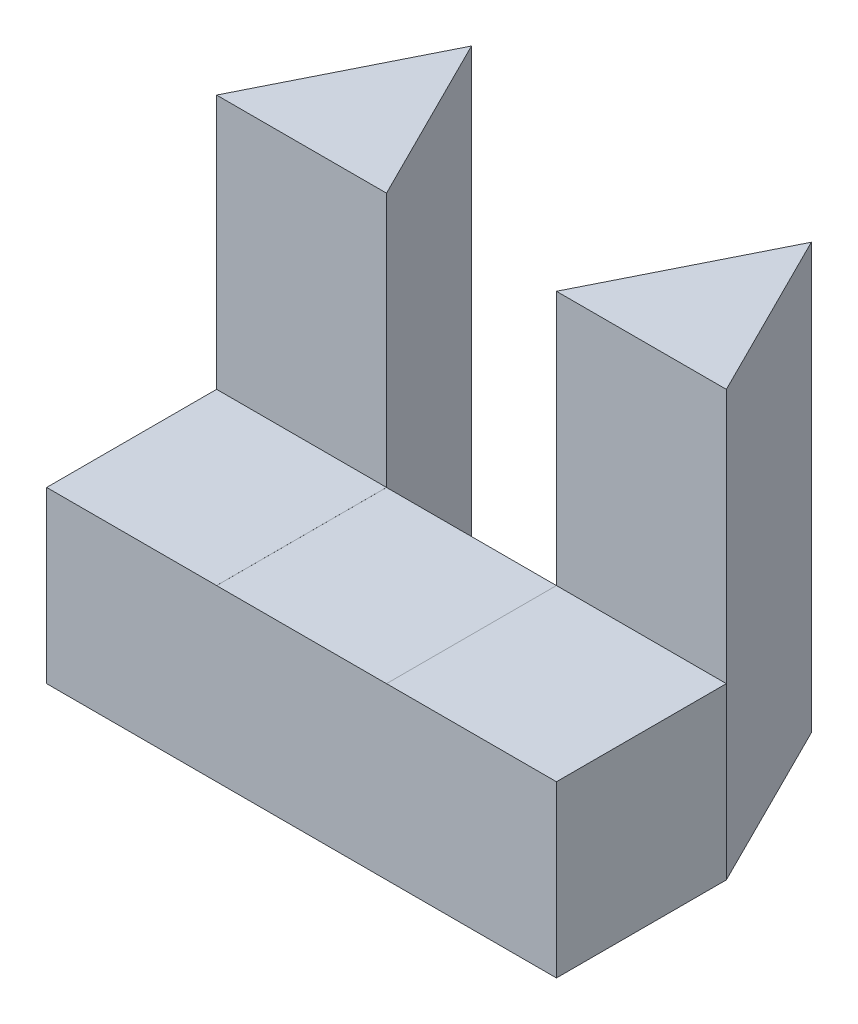
ISO-10303-21;
HEADER;
FILE_DESCRIPTION(('STEP AP214'),'2;1');
FILE_NAME('part.step','',(''),(''),'','','');
FILE_SCHEMA(('AUTOMOTIVE_DESIGN { 1 0 10303 214 1 1 1 1 }'));
ENDSEC;
DATA;
#1=APPLICATION_CONTEXT('core data for automotive mechanical design processes');
#2=APPLICATION_PROTOCOL_DEFINITION('international standard','automotive_design',2000,#1);
#3=PRODUCT_CONTEXT('',#1,'mechanical');
#4=PRODUCT('Part','Part','',(#3));
#5=PRODUCT_RELATED_PRODUCT_CATEGORY('part','',(#4));
#6=PRODUCT_DEFINITION_FORMATION('','',#4);
#7=PRODUCT_DEFINITION_CONTEXT('part definition',#1,'design');
#8=PRODUCT_DEFINITION('design','',#6,#7);
#9=PRODUCT_DEFINITION_SHAPE('','',#8);
#10=(LENGTH_UNIT() NAMED_UNIT(*) SI_UNIT(.MILLI.,.METRE.));
#11=(NAMED_UNIT(*) PLANE_ANGLE_UNIT() SI_UNIT($,.RADIAN.));
#12=(NAMED_UNIT(*) SI_UNIT($,.STERADIAN.) SOLID_ANGLE_UNIT());
#13=UNCERTAINTY_MEASURE_WITH_UNIT(LENGTH_MEASURE(1.E-05),#10,'distance_accuracy_value','');
#14=(GEOMETRIC_REPRESENTATION_CONTEXT(3) GLOBAL_UNCERTAINTY_ASSIGNED_CONTEXT((#13)) GLOBAL_UNIT_ASSIGNED_CONTEXT((#10,
#11,#12)) REPRESENTATION_CONTEXT('',''));
#15=CARTESIAN_POINT('',(0.,0.,0.));
#16=DIRECTION('',(0.,0.,1.));
#17=DIRECTION('',(1.,0.,0.));
#18=AXIS2_PLACEMENT_3D('',#15,#16,#17);
#19=CARTESIAN_POINT('',(0.,5.,0.));
#20=DIRECTION('',(0.,1.,0.));
#21=DIRECTION('',(0.,0.,1.));
#22=AXIS2_PLACEMENT_3D('',#19,#20,#21);
#23=PLANE('',#22);
#24=DIRECTION('',(-1.,0.,0.));
#25=VECTOR('',#24,1.);
#26=CARTESIAN_POINT('',(15.,5.,-2.));
#27=LINE('',#26,#25);
#28=CARTESIAN_POINT('',(2.,5.,-2.));
#29=VERTEX_POINT('',#28);
#30=CARTESIAN_POINT('',(0.,5.,-2.));
#31=VERTEX_POINT('',#30);
#32=EDGE_CURVE('E139',#29,#31,#27,.T.);
#33=ORIENTED_EDGE('',*,*,#32,.F.);
#34=DIRECTION('',(-0.447213595499958,0.,-0.894427190999916));
#35=VECTOR('',#34,1.);
#36=CARTESIAN_POINT('',(2.,5.,-2.));
#37=LINE('',#36,#35);
#38=CARTESIAN_POINT('',(1.,5.,-4.));
#39=VERTEX_POINT('',#38);
#40=EDGE_CURVE('E159',#29,#39,#37,.T.);
#41=ORIENTED_EDGE('',*,*,#40,.T.);
#42=DIRECTION('',(-0.447213595499958,0.,0.894427190999916));
#43=VECTOR('',#42,1.);
#44=CARTESIAN_POINT('',(1.,5.,-4.));
#45=LINE('',#44,#43);
#46=EDGE_CURVE('E158',#39,#31,#45,.T.);
#47=ORIENTED_EDGE('',*,*,#46,.T.);
#48=EDGE_LOOP('',(#33,#41,#47));
#49=FACE_BOUND('',#48,.T.);
#50=ADVANCED_FACE('F33',(#49),#23,.T.);
#51=CARTESIAN_POINT('',(0.,5.,-2.));
#52=DIRECTION('',(1.,0.,0.));
#53=DIRECTION('',(0.,0.,-1.));
#54=AXIS2_PLACEMENT_3D('',#51,#52,#53);
#55=PLANE('',#54);
#56=DIRECTION('',(0.,-1.,0.));
#57=VECTOR('',#56,1.);
#58=CARTESIAN_POINT('',(0.,5.,0.));
#59=LINE('',#58,#57);
#60=CARTESIAN_POINT('',(0.,2.00044380215793,0.));
#61=VERTEX_POINT('',#60);
#62=CARTESIAN_POINT('',(0.,0.,0.));
#63=VERTEX_POINT('',#62);
#64=EDGE_CURVE('E151',#61,#63,#59,.T.);
#65=ORIENTED_EDGE('',*,*,#64,.F.);
#66=DIRECTION('',(0.,0.,1.));
#67=VECTOR('',#66,1.);
#68=CARTESIAN_POINT('',(0.,2.00044380215793,-2.));
#69=LINE('',#68,#67);
#70=CARTESIAN_POINT('',(0.,2.00044380215793,-2.));
#71=VERTEX_POINT('',#70);
#72=EDGE_CURVE('E130',#71,#61,#69,.T.);
#73=ORIENTED_EDGE('',*,*,#72,.F.);
#74=DIRECTION('',(0.,-1.,0.));
#75=VECTOR('',#74,1.);
#76=CARTESIAN_POINT('',(0.,5.,-2.));
#77=LINE('',#76,#75);
#78=CARTESIAN_POINT('',(0.,0.,-2.));
#79=VERTEX_POINT('',#78);
#80=EDGE_CURVE('E145',#71,#79,#77,.T.);
#81=ORIENTED_EDGE('',*,*,#80,.T.);
#82=DIRECTION('',(0.,0.,1.));
#83=VECTOR('',#82,1.);
#84=CARTESIAN_POINT('',(0.,0.,-2.));
#85=LINE('',#84,#83);
#86=EDGE_CURVE('E211',#79,#63,#85,.T.);
#87=ORIENTED_EDGE('',*,*,#86,.T.);
#88=EDGE_LOOP('',(#65,#73,#81,#87));
#89=FACE_BOUND('',#88,.T.);
#90=ADVANCED_FACE('F35',(#89),#55,.F.);
#91=CARTESIAN_POINT('',(0.,5.,0.));
#92=DIRECTION('',(0.,0.,-1.));
#93=DIRECTION('',(-1.,0.,0.));
#94=AXIS2_PLACEMENT_3D('',#91,#92,#93);
#95=PLANE('',#94);
#96=DIRECTION('',(0.,-1.,0.));
#97=VECTOR('',#96,1.);
#98=CARTESIAN_POINT('',(6.,5.,0.));
#99=LINE('',#98,#97);
#100=CARTESIAN_POINT('',(6.,2.00044380215793,0.));
#101=VERTEX_POINT('',#100);
#102=CARTESIAN_POINT('',(6.,0.,0.));
#103=VERTEX_POINT('',#102);
#104=EDGE_CURVE('E181',#101,#103,#99,.T.);
#105=ORIENTED_EDGE('',*,*,#104,.F.);
#106=DIRECTION('',(-1.,0.,0.));
#107=VECTOR('',#106,1.);
#108=CARTESIAN_POINT('',(15.,2.00044380215793,0.));
#109=LINE('',#108,#107);
#110=CARTESIAN_POINT('',(4.,2.00044380215793,0.));
#111=VERTEX_POINT('',#110);
#112=EDGE_CURVE('E253',#101,#111,#109,.T.);
#113=ORIENTED_EDGE('',*,*,#112,.T.);
#114=DIRECTION('',(0.,1.,0.));
#115=VECTOR('',#114,1.);
#116=CARTESIAN_POINT('',(4.,5.,0.));
#117=LINE('',#116,#115);
#118=CARTESIAN_POINT('',(4.,2.,0.));
#119=VERTEX_POINT('',#118);
#120=EDGE_CURVE('E216',#119,#111,#117,.T.);
#121=ORIENTED_EDGE('',*,*,#120,.F.);
#122=DIRECTION('',(1.,0.,0.));
#123=VECTOR('',#122,1.);
#124=CARTESIAN_POINT('',(2.,2.,0.));
#125=LINE('',#124,#123);
#126=CARTESIAN_POINT('',(2.,2.,0.));
#127=VERTEX_POINT('',#126);
#128=EDGE_CURVE('E209',#127,#119,#125,.T.);
#129=ORIENTED_EDGE('',*,*,#128,.F.);
#130=DIRECTION('',(0.,-1.,0.));
#131=VECTOR('',#130,1.);
#132=CARTESIAN_POINT('',(2.,5.,0.));
#133=LINE('',#132,#131);
#134=CARTESIAN_POINT('',(2.,2.00044380215793,0.));
#135=VERTEX_POINT('',#134);
#136=EDGE_CURVE('E252',#135,#127,#133,.T.);
#137=ORIENTED_EDGE('',*,*,#136,.F.);
#138=EDGE_CURVE('E48',#135,#61,#109,.T.);
#139=ORIENTED_EDGE('',*,*,#138,.T.);
#140=ORIENTED_EDGE('',*,*,#64,.T.);
#141=DIRECTION('',(1.,0.,0.));
#142=VECTOR('',#141,1.);
#143=CARTESIAN_POINT('',(0.,0.,0.));
#144=LINE('',#143,#142);
#145=EDGE_CURVE('E214',#63,#103,#144,.T.);
#146=ORIENTED_EDGE('',*,*,#145,.T.);
#147=EDGE_LOOP('',(#105,#113,#121,#129,#137,#139,#140,#146));
#148=FACE_BOUND('',#147,.T.);
#149=ADVANCED_FACE('F249',(#148),#95,.F.);
#150=CARTESIAN_POINT('',(6.,5.,0.));
#151=DIRECTION('',(-1.,0.,0.));
#152=DIRECTION('',(0.,0.,1.));
#153=AXIS2_PLACEMENT_3D('',#150,#151,#152);
#154=PLANE('',#153);
#155=DIRECTION('',(0.,-1.,0.));
#156=VECTOR('',#155,1.);
#157=CARTESIAN_POINT('',(6.,5.,-2.));
#158=LINE('',#157,#156);
#159=CARTESIAN_POINT('',(6.,2.00044380215793,-2.));
#160=VERTEX_POINT('',#159);
#161=CARTESIAN_POINT('',(6.,0.,-2.));
#162=VERTEX_POINT('',#161);
#163=EDGE_CURVE('E177',#160,#162,#158,.T.);
#164=ORIENTED_EDGE('',*,*,#163,.F.);
#165=DIRECTION('',(0.,0.,1.));
#166=VECTOR('',#165,1.);
#167=CARTESIAN_POINT('',(6.,2.00044380215793,0.));
#168=LINE('',#167,#166);
#169=EDGE_CURVE('E258',#160,#101,#168,.T.);
#170=ORIENTED_EDGE('',*,*,#169,.T.);
#171=ORIENTED_EDGE('',*,*,#104,.T.);
#172=DIRECTION('',(0.,0.,-1.));
#173=VECTOR('',#172,1.);
#174=CARTESIAN_POINT('',(6.,0.,0.));
#175=LINE('',#174,#173);
#176=EDGE_CURVE('E229',#103,#162,#175,.T.);
#177=ORIENTED_EDGE('',*,*,#176,.T.);
#178=EDGE_LOOP('',(#164,#170,#171,#177));
#179=FACE_BOUND('',#178,.T.);
#180=ADVANCED_FACE('F265',(#179),#154,.F.);
#181=CARTESIAN_POINT('',(6.,5.,-2.));
#182=DIRECTION('',(-0.894427190999916,0.,0.447213595499958));
#183=DIRECTION('',(0.447213595499958,0.,0.894427190999916));
#184=AXIS2_PLACEMENT_3D('',#181,#182,#183);
#185=PLANE('',#184);
#186=DIRECTION('',(-0.447213595499958,0.,-0.894427190999916));
#187=VECTOR('',#186,1.);
#188=CARTESIAN_POINT('',(6.,0.,-2.));
#189=LINE('',#188,#187);
#190=CARTESIAN_POINT('',(5.,0.,-4.));
#191=VERTEX_POINT('',#190);
#192=EDGE_CURVE('E232',#162,#191,#189,.T.);
#193=ORIENTED_EDGE('',*,*,#192,.T.);
#194=DIRECTION('',(0.,-1.,0.));
#195=VECTOR('',#194,1.);
#196=CARTESIAN_POINT('',(5.,5.,-4.));
#197=LINE('',#196,#195);
#198=CARTESIAN_POINT('',(5.,5.,-4.));
#199=VERTEX_POINT('',#198);
#200=EDGE_CURVE('E173',#199,#191,#197,.T.);
#201=ORIENTED_EDGE('',*,*,#200,.F.);
#202=DIRECTION('',(-0.447213595499958,0.,-0.894427190999916));
#203=VECTOR('',#202,1.);
#204=CARTESIAN_POINT('',(6.,5.,-2.));
#205=LINE('',#204,#203);
#206=CARTESIAN_POINT('',(6.,5.,-2.));
#207=VERTEX_POINT('',#206);
#208=EDGE_CURVE('E221',#207,#199,#205,.T.);
#209=ORIENTED_EDGE('',*,*,#208,.F.);
#210=EDGE_CURVE('E178',#207,#160,#158,.T.);
#211=ORIENTED_EDGE('',*,*,#210,.T.);
#212=ORIENTED_EDGE('',*,*,#163,.T.);
#213=EDGE_LOOP('',(#193,#201,#209,#211,#212));
#214=FACE_BOUND('',#213,.T.);
#215=ADVANCED_FACE('F268',(#214),#185,.F.);
#216=CARTESIAN_POINT('',(5.,5.,-4.));
#217=DIRECTION('',(0.894427190999916,0.,0.447213595499958));
#218=DIRECTION('',(0.447213595499958,0.,-0.894427190999916));
#219=AXIS2_PLACEMENT_3D('',#216,#217,#218);
#220=PLANE('',#219);
#221=DIRECTION('',(-0.447213595499958,0.,0.894427190999916));
#222=VECTOR('',#221,1.);
#223=CARTESIAN_POINT('',(5.,0.,-4.));
#224=LINE('',#223,#222);
#225=CARTESIAN_POINT('',(4.,0.,-2.));
#226=VERTEX_POINT('',#225);
#227=EDGE_CURVE('E200',#191,#226,#224,.T.);
#228=ORIENTED_EDGE('',*,*,#227,.T.);
#229=DIRECTION('',(0.,-1.,0.));
#230=VECTOR('',#229,1.);
#231=CARTESIAN_POINT('',(4.,5.,-2.));
#232=LINE('',#231,#230);
#233=CARTESIAN_POINT('',(4.,2.,-2.));
#234=VERTEX_POINT('',#233);
#235=EDGE_CURVE('E169',#234,#226,#232,.T.);
#236=ORIENTED_EDGE('',*,*,#235,.F.);
#237=CARTESIAN_POINT('',(4.,2.00044380215793,-2.));
#238=VERTEX_POINT('',#237);
#239=EDGE_CURVE('E174',#238,#234,#232,.T.);
#240=ORIENTED_EDGE('',*,*,#239,.F.);
#241=CARTESIAN_POINT('',(4.,5.,-2.));
#242=VERTEX_POINT('',#241);
#243=EDGE_CURVE('E171',#242,#238,#232,.T.);
#244=ORIENTED_EDGE('',*,*,#243,.F.);
#245=DIRECTION('',(-0.447213595499958,0.,0.894427190999916));
#246=VECTOR('',#245,1.);
#247=CARTESIAN_POINT('',(5.,5.,-4.));
#248=LINE('',#247,#246);
#249=EDGE_CURVE('E223',#199,#242,#248,.T.);
#250=ORIENTED_EDGE('',*,*,#249,.F.);
#251=ORIENTED_EDGE('',*,*,#200,.T.);
#252=EDGE_LOOP('',(#228,#236,#240,#244,#250,#251));
#253=FACE_BOUND('',#252,.T.);
#254=ADVANCED_FACE('F197',(#253),#220,.F.);
#255=CARTESIAN_POINT('',(4.,5.,-2.));
#256=DIRECTION('',(0.,0.,1.));
#257=DIRECTION('',(1.,0.,0.));
#258=AXIS2_PLACEMENT_3D('',#255,#256,#257);
#259=PLANE('',#258);
#260=DIRECTION('',(0.,-1.,0.));
#261=VECTOR('',#260,1.);
#262=CARTESIAN_POINT('',(2.,5.,-2.));
#263=LINE('',#262,#261);
#264=CARTESIAN_POINT('',(2.,2.,-2.));
#265=VERTEX_POINT('',#264);
#266=CARTESIAN_POINT('',(2.,0.,-2.));
#267=VERTEX_POINT('',#266);
#268=EDGE_CURVE('E165',#265,#267,#263,.T.);
#269=ORIENTED_EDGE('',*,*,#268,.F.);
#270=DIRECTION('',(1.,0.,0.));
#271=VECTOR('',#270,1.);
#272=CARTESIAN_POINT('',(4.,2.,-2.));
#273=LINE('',#272,#271);
#274=EDGE_CURVE('E41',#265,#234,#273,.T.);
#275=ORIENTED_EDGE('',*,*,#274,.T.);
#276=ORIENTED_EDGE('',*,*,#235,.T.);
#277=DIRECTION('',(-1.,0.,0.));
#278=VECTOR('',#277,1.);
#279=CARTESIAN_POINT('',(4.,0.,-2.));
#280=LINE('',#279,#278);
#281=EDGE_CURVE('E235',#226,#267,#280,.T.);
#282=ORIENTED_EDGE('',*,*,#281,.T.);
#283=EDGE_LOOP('',(#269,#275,#276,#282));
#284=FACE_BOUND('',#283,.T.);
#285=ADVANCED_FACE('F188',(#284),#259,.F.);
#286=CARTESIAN_POINT('',(2.,5.,-2.));
#287=DIRECTION('',(-0.894427190999916,0.,0.447213595499958));
#288=DIRECTION('',(0.447213595499958,0.,0.894427190999916));
#289=AXIS2_PLACEMENT_3D('',#286,#287,#288);
#290=PLANE('',#289);
#291=DIRECTION('',(-0.447213595499958,0.,-0.894427190999916));
#292=VECTOR('',#291,1.);
#293=CARTESIAN_POINT('',(2.,0.,-2.));
#294=LINE('',#293,#292);
#295=CARTESIAN_POINT('',(1.,0.,-4.));
#296=VERTEX_POINT('',#295);
#297=EDGE_CURVE('E236',#267,#296,#294,.T.);
#298=ORIENTED_EDGE('',*,*,#297,.T.);
#299=DIRECTION('',(0.,-1.,0.));
#300=VECTOR('',#299,1.);
#301=CARTESIAN_POINT('',(1.,5.,-4.));
#302=LINE('',#301,#300);
#303=EDGE_CURVE('E144',#39,#296,#302,.T.);
#304=ORIENTED_EDGE('',*,*,#303,.F.);
#305=ORIENTED_EDGE('',*,*,#40,.F.);
#306=CARTESIAN_POINT('',(2.,2.00044380215793,-2.));
#307=VERTEX_POINT('',#306);
#308=EDGE_CURVE('E166',#29,#307,#263,.T.);
#309=ORIENTED_EDGE('',*,*,#308,.T.);
#310=EDGE_CURVE('E170',#307,#265,#263,.T.);
#311=ORIENTED_EDGE('',*,*,#310,.T.);
#312=ORIENTED_EDGE('',*,*,#268,.T.);
#313=EDGE_LOOP('',(#298,#304,#305,#309,#311,#312));
#314=FACE_BOUND('',#313,.T.);
#315=ADVANCED_FACE('F240',(#314),#290,.F.);
#316=CARTESIAN_POINT('',(1.,5.,-4.));
#317=DIRECTION('',(0.894427190999916,0.,0.447213595499958));
#318=DIRECTION('',(0.447213595499958,0.,-0.894427190999916));
#319=AXIS2_PLACEMENT_3D('',#316,#317,#318);
#320=PLANE('',#319);
#321=DIRECTION('',(-0.447213595499958,0.,0.894427190999916));
#322=VECTOR('',#321,1.);
#323=CARTESIAN_POINT('',(1.,0.,-4.));
#324=LINE('',#323,#322);
#325=EDGE_CURVE('E156',#296,#79,#324,.T.);
#326=ORIENTED_EDGE('',*,*,#325,.T.);
#327=ORIENTED_EDGE('',*,*,#80,.F.);
#328=EDGE_CURVE('E136',#31,#71,#77,.T.);
#329=ORIENTED_EDGE('',*,*,#328,.F.);
#330=ORIENTED_EDGE('',*,*,#46,.F.);
#331=ORIENTED_EDGE('',*,*,#303,.T.);
#332=EDGE_LOOP('',(#326,#327,#329,#330,#331));
#333=FACE_BOUND('',#332,.T.);
#334=ADVANCED_FACE('F153',(#333),#320,.F.);
#335=EDGE_CURVE('E259',#207,#242,#27,.T.);
#336=ORIENTED_EDGE('',*,*,#335,.F.);
#337=ORIENTED_EDGE('',*,*,#208,.T.);
#338=ORIENTED_EDGE('',*,*,#249,.T.);
#339=EDGE_LOOP('',(#336,#337,#338));
#340=FACE_BOUND('',#339,.T.);
#341=ADVANCED_FACE('F274',(#340),#23,.T.);
#342=CARTESIAN_POINT('',(0.,0.,0.));
#343=DIRECTION('',(0.,1.,0.));
#344=DIRECTION('',(0.,0.,1.));
#345=AXIS2_PLACEMENT_3D('',#342,#343,#344);
#346=PLANE('',#345);
#347=ORIENTED_EDGE('',*,*,#86,.F.);
#348=ORIENTED_EDGE('',*,*,#325,.F.);
#349=ORIENTED_EDGE('',*,*,#297,.F.);
#350=ORIENTED_EDGE('',*,*,#281,.F.);
#351=ORIENTED_EDGE('',*,*,#227,.F.);
#352=ORIENTED_EDGE('',*,*,#192,.F.);
#353=ORIENTED_EDGE('',*,*,#176,.F.);
#354=ORIENTED_EDGE('',*,*,#145,.F.);
#355=EDGE_LOOP('',(#347,#348,#349,#350,#351,#352,#353,#354));
#356=FACE_BOUND('',#355,.T.);
#357=ADVANCED_FACE('F243',(#356),#346,.F.);
#358=CARTESIAN_POINT('',(2.,2.,-5.));
#359=DIRECTION('',(0.,-1.,0.));
#360=DIRECTION('',(0.,0.,-1.));
#361=AXIS2_PLACEMENT_3D('',#358,#359,#360);
#362=PLANE('',#361);
#363=DIRECTION('',(0.,0.,1.));
#364=VECTOR('',#363,1.);
#365=CARTESIAN_POINT('',(2.,2.,-5.));
#366=LINE('',#365,#364);
#367=EDGE_CURVE('E212',#265,#127,#366,.T.);
#368=ORIENTED_EDGE('',*,*,#367,.T.);
#369=ORIENTED_EDGE('',*,*,#128,.T.);
#370=DIRECTION('',(0.,0.,1.));
#371=VECTOR('',#370,1.);
#372=CARTESIAN_POINT('',(4.,2.,-5.));
#373=LINE('',#372,#371);
#374=EDGE_CURVE('E205',#234,#119,#373,.T.);
#375=ORIENTED_EDGE('',*,*,#374,.F.);
#376=ORIENTED_EDGE('',*,*,#274,.F.);
#377=EDGE_LOOP('',(#368,#369,#375,#376));
#378=FACE_BOUND('',#377,.T.);
#379=ADVANCED_FACE('F207',(#378),#362,.F.);
#380=CARTESIAN_POINT('',(2.,5.,-5.));
#381=DIRECTION('',(-1.,0.,0.));
#382=DIRECTION('',(0.,-1.,0.));
#383=AXIS2_PLACEMENT_3D('',#380,#381,#382);
#384=PLANE('',#383);
#385=ORIENTED_EDGE('',*,*,#310,.F.);
#386=DIRECTION('',(0.,0.,1.));
#387=VECTOR('',#386,1.);
#388=CARTESIAN_POINT('',(2.,2.00044380215793,-5.));
#389=LINE('',#388,#387);
#390=EDGE_CURVE('E131',#307,#135,#389,.T.);
#391=ORIENTED_EDGE('',*,*,#390,.T.);
#392=ORIENTED_EDGE('',*,*,#136,.T.);
#393=ORIENTED_EDGE('',*,*,#367,.F.);
#394=EDGE_LOOP('',(#385,#391,#392,#393));
#395=FACE_BOUND('',#394,.T.);
#396=ADVANCED_FACE('F291',(#395),#384,.F.);
#397=CARTESIAN_POINT('',(4.,5.,-5.));
#398=DIRECTION('',(1.,0.,0.));
#399=DIRECTION('',(0.,0.,-1.));
#400=AXIS2_PLACEMENT_3D('',#397,#398,#399);
#401=PLANE('',#400);
#402=ORIENTED_EDGE('',*,*,#120,.T.);
#403=DIRECTION('',(0.,0.,-1.));
#404=VECTOR('',#403,1.);
#405=CARTESIAN_POINT('',(4.,2.00044380215793,-5.));
#406=LINE('',#405,#404);
#407=EDGE_CURVE('E11',#111,#238,#406,.T.);
#408=ORIENTED_EDGE('',*,*,#407,.T.);
#409=ORIENTED_EDGE('',*,*,#239,.T.);
#410=ORIENTED_EDGE('',*,*,#374,.T.);
#411=EDGE_LOOP('',(#402,#408,#409,#410));
#412=FACE_BOUND('',#411,.T.);
#413=ADVANCED_FACE('F204',(#412),#401,.F.);
#414=CARTESIAN_POINT('',(15.,2.00044380215793,-2.));
#415=DIRECTION('',(0.,-1.,0.));
#416=DIRECTION('',(0.,0.,-1.));
#417=AXIS2_PLACEMENT_3D('',#414,#415,#416);
#418=PLANE('',#417);
#419=DIRECTION('',(-1.,0.,0.));
#420=VECTOR('',#419,1.);
#421=CARTESIAN_POINT('',(15.,2.00044380215793,-2.));
#422=LINE('',#421,#420);
#423=EDGE_CURVE('E56',#160,#238,#422,.T.);
#424=ORIENTED_EDGE('',*,*,#423,.T.);
#425=ORIENTED_EDGE('',*,*,#407,.F.);
#426=ORIENTED_EDGE('',*,*,#112,.F.);
#427=ORIENTED_EDGE('',*,*,#169,.F.);
#428=EDGE_LOOP('',(#424,#425,#426,#427));
#429=FACE_BOUND('',#428,.T.);
#430=ADVANCED_FACE('F262',(#429),#418,.F.);
#431=CARTESIAN_POINT('',(15.,5.,-2.));
#432=DIRECTION('',(0.,0.,-1.));
#433=DIRECTION('',(-1.,0.,0.));
#434=AXIS2_PLACEMENT_3D('',#431,#432,#433);
#435=PLANE('',#434);
#436=ORIENTED_EDGE('',*,*,#335,.T.);
#437=ORIENTED_EDGE('',*,*,#243,.T.);
#438=ORIENTED_EDGE('',*,*,#423,.F.);
#439=ORIENTED_EDGE('',*,*,#210,.F.);
#440=EDGE_LOOP('',(#436,#437,#438,#439));
#441=FACE_BOUND('',#440,.T.);
#442=ADVANCED_FACE('F272',(#441),#435,.F.);
#443=ORIENTED_EDGE('',*,*,#32,.T.);
#444=ORIENTED_EDGE('',*,*,#328,.T.);
#445=EDGE_CURVE('E126',#307,#71,#422,.T.);
#446=ORIENTED_EDGE('',*,*,#445,.F.);
#447=ORIENTED_EDGE('',*,*,#308,.F.);
#448=EDGE_LOOP('',(#443,#444,#446,#447));
#449=FACE_BOUND('',#448,.T.);
#450=ADVANCED_FACE('F137',(#449),#435,.F.);
#451=ORIENTED_EDGE('',*,*,#445,.T.);
#452=ORIENTED_EDGE('',*,*,#72,.T.);
#453=ORIENTED_EDGE('',*,*,#138,.F.);
#454=ORIENTED_EDGE('',*,*,#390,.F.);
#455=EDGE_LOOP('',(#451,#452,#453,#454));
#456=FACE_BOUND('',#455,.T.);
#457=ADVANCED_FACE('F128',(#456),#418,.F.);
#458=CLOSED_SHELL('',(#50,#90,#149,#180,#215,#254,#285,#315,#334,#341,#357,#379,#396,#413,#430,
#442,#450,#457));
#459=MANIFOLD_SOLID_BREP('B2',#458);
#460=ADVANCED_BREP_SHAPE_REPRESENTATION('',(#18,#459),#14);
#461=SHAPE_DEFINITION_REPRESENTATION(#9,#460);
ENDSEC;
END-ISO-10303-21;
